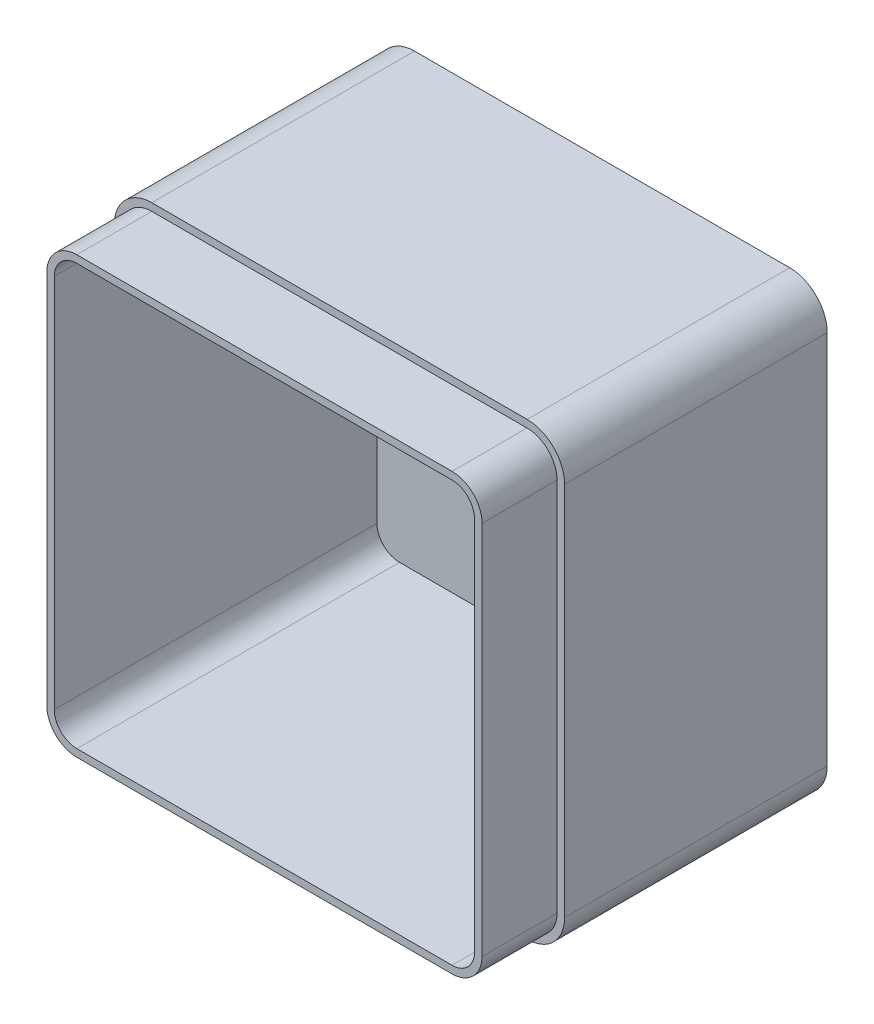
ISO-10303-21;
HEADER;
FILE_DESCRIPTION(('STEP AP214'),'2;1');
FILE_NAME('part.step','',(''),(''),'','','');
FILE_SCHEMA(('AUTOMOTIVE_DESIGN { 1 0 10303 214 1 1 1 1 }'));
ENDSEC;
DATA;
#1=APPLICATION_CONTEXT('core data for automotive mechanical design processes');
#2=APPLICATION_PROTOCOL_DEFINITION('international standard','automotive_design',2000,#1);
#3=PRODUCT_CONTEXT('',#1,'mechanical');
#4=PRODUCT('Part','Part','',(#3));
#5=PRODUCT_RELATED_PRODUCT_CATEGORY('part','',(#4));
#6=PRODUCT_DEFINITION_FORMATION('','',#4);
#7=PRODUCT_DEFINITION_CONTEXT('part definition',#1,'design');
#8=PRODUCT_DEFINITION('design','',#6,#7);
#9=PRODUCT_DEFINITION_SHAPE('','',#8);
#10=(LENGTH_UNIT() NAMED_UNIT(*) SI_UNIT(.MILLI.,.METRE.));
#11=(NAMED_UNIT(*) PLANE_ANGLE_UNIT() SI_UNIT($,.RADIAN.));
#12=(NAMED_UNIT(*) SI_UNIT($,.STERADIAN.) SOLID_ANGLE_UNIT());
#13=UNCERTAINTY_MEASURE_WITH_UNIT(LENGTH_MEASURE(1.E-05),#10,'distance_accuracy_value','');
#14=(GEOMETRIC_REPRESENTATION_CONTEXT(3) GLOBAL_UNCERTAINTY_ASSIGNED_CONTEXT((#13)) GLOBAL_UNIT_ASSIGNED_CONTEXT((#10,
#11,#12)) REPRESENTATION_CONTEXT('',''));
#15=CARTESIAN_POINT('',(0.,0.,0.));
#16=DIRECTION('',(0.,0.,1.));
#17=DIRECTION('',(1.,0.,0.));
#18=AXIS2_PLACEMENT_3D('',#15,#16,#17);
#19=CARTESIAN_POINT('',(0.,0.,90.));
#20=DIRECTION('',(0.,0.,-1.));
#21=DIRECTION('',(-1.,0.,0.));
#22=AXIS2_PLACEMENT_3D('',#19,#20,#21);
#23=PLANE('',#22);
#24=DIRECTION('',(0.,-1.,0.));
#25=VECTOR('',#24,1.);
#26=CARTESIAN_POINT('',(4.,0.,90.));
#27=LINE('',#26,#25);
#28=CARTESIAN_POINT('',(3.99999999999999,110.,90.));
#29=VERTEX_POINT('',#28);
#30=CARTESIAN_POINT('',(4.,10.,90.));
#31=VERTEX_POINT('',#30);
#32=EDGE_CURVE('E304',#29,#31,#27,.T.);
#33=ORIENTED_EDGE('',*,*,#32,.F.);
#34=CARTESIAN_POINT('',(9.99999999999999,110.,90.));
#35=DIRECTION('',(0.,0.,-1.));
#36=DIRECTION('',(-1.,0.,0.));
#37=AXIS2_PLACEMENT_3D('',#34,#35,#36);
#38=CIRCLE('',#37,6.);
#39=CARTESIAN_POINT('',(9.99999999999998,116.,90.));
#40=VERTEX_POINT('',#39);
#41=EDGE_CURVE('E337',#40,#29,#38,.F.);
#42=ORIENTED_EDGE('',*,*,#41,.F.);
#43=DIRECTION('',(-1.,0.,0.));
#44=VECTOR('',#43,1.);
#45=CARTESIAN_POINT('',(0.,116.,90.));
#46=LINE('',#45,#44);
#47=CARTESIAN_POINT('',(110.,116.,90.));
#48=VERTEX_POINT('',#47);
#49=EDGE_CURVE('E314',#48,#40,#46,.T.);
#50=ORIENTED_EDGE('',*,*,#49,.F.);
#51=CARTESIAN_POINT('',(110.,110.,90.));
#52=DIRECTION('',(0.,0.,-1.));
#53=DIRECTION('',(-1.,0.,0.));
#54=AXIS2_PLACEMENT_3D('',#51,#52,#53);
#55=CIRCLE('',#54,6.);
#56=CARTESIAN_POINT('',(116.,110.,90.));
#57=VERTEX_POINT('',#56);
#58=EDGE_CURVE('E288',#57,#48,#55,.F.);
#59=ORIENTED_EDGE('',*,*,#58,.F.);
#60=DIRECTION('',(0.,1.,0.));
#61=VECTOR('',#60,1.);
#62=CARTESIAN_POINT('',(116.,0.,90.));
#63=LINE('',#62,#61);
#64=CARTESIAN_POINT('',(116.,10.,90.));
#65=VERTEX_POINT('',#64);
#66=EDGE_CURVE('E335',#65,#57,#63,.T.);
#67=ORIENTED_EDGE('',*,*,#66,.F.);
#68=CARTESIAN_POINT('',(110.,10.,90.));
#69=DIRECTION('',(0.,0.,-1.));
#70=DIRECTION('',(-1.,0.,0.));
#71=AXIS2_PLACEMENT_3D('',#68,#69,#70);
#72=CIRCLE('',#71,6.);
#73=CARTESIAN_POINT('',(110.,4.,90.));
#74=VERTEX_POINT('',#73);
#75=EDGE_CURVE('E332',#74,#65,#72,.F.);
#76=ORIENTED_EDGE('',*,*,#75,.F.);
#77=DIRECTION('',(1.,0.,0.));
#78=VECTOR('',#77,1.);
#79=CARTESIAN_POINT('',(0.,4.,90.));
#80=LINE('',#79,#78);
#81=CARTESIAN_POINT('',(9.99999999999999,4.,90.));
#82=VERTEX_POINT('',#81);
#83=EDGE_CURVE('E330',#82,#74,#80,.T.);
#84=ORIENTED_EDGE('',*,*,#83,.F.);
#85=CARTESIAN_POINT('',(9.99999999999999,10.,90.));
#86=DIRECTION('',(0.,0.,-1.));
#87=DIRECTION('',(-1.,0.,0.));
#88=AXIS2_PLACEMENT_3D('',#85,#86,#87);
#89=CIRCLE('',#88,6.);
#90=EDGE_CURVE('E321',#31,#82,#89,.F.);
#91=ORIENTED_EDGE('',*,*,#90,.F.);
#92=EDGE_LOOP('',(#33,#42,#50,#59,#67,#76,#84,#91));
#93=FACE_BOUND('',#92,.T.);
#94=CARTESIAN_POINT('',(9.99999999999999,110.,90.));
#95=DIRECTION('',(0.,0.,1.));
#96=DIRECTION('',(1.,0.,0.));
#97=AXIS2_PLACEMENT_3D('',#94,#95,#96);
#98=CIRCLE('',#97,8.);
#99=CARTESIAN_POINT('',(9.99999999999998,118.,90.));
#100=VERTEX_POINT('',#99);
#101=CARTESIAN_POINT('',(1.99999999999999,110.,90.));
#102=VERTEX_POINT('',#101);
#103=EDGE_CURVE('E240',#100,#102,#98,.T.);
#104=ORIENTED_EDGE('',*,*,#103,.T.);
#105=DIRECTION('',(0.,-1.,0.));
#106=VECTOR('',#105,1.);
#107=CARTESIAN_POINT('',(1.99999999999999,110.,90.));
#108=LINE('',#107,#106);
#109=CARTESIAN_POINT('',(2.,9.99999999999999,90.));
#110=VERTEX_POINT('',#109);
#111=EDGE_CURVE('E200',#102,#110,#108,.T.);
#112=ORIENTED_EDGE('',*,*,#111,.T.);
#113=CARTESIAN_POINT('',(9.99999999999999,10.,90.));
#114=DIRECTION('',(0.,0.,1.));
#115=DIRECTION('',(1.,0.,0.));
#116=AXIS2_PLACEMENT_3D('',#113,#114,#115);
#117=CIRCLE('',#116,8.);
#118=CARTESIAN_POINT('',(9.99999999999999,2.,90.));
#119=VERTEX_POINT('',#118);
#120=EDGE_CURVE('E48',#110,#119,#117,.T.);
#121=ORIENTED_EDGE('',*,*,#120,.T.);
#122=DIRECTION('',(1.,0.,0.));
#123=VECTOR('',#122,1.);
#124=CARTESIAN_POINT('',(10.,2.,90.));
#125=LINE('',#124,#123);
#126=CARTESIAN_POINT('',(110.,2.,90.));
#127=VERTEX_POINT('',#126);
#128=EDGE_CURVE('E244',#119,#127,#125,.T.);
#129=ORIENTED_EDGE('',*,*,#128,.T.);
#130=CARTESIAN_POINT('',(110.,10.,90.));
#131=DIRECTION('',(0.,0.,1.));
#132=DIRECTION('',(1.,0.,0.));
#133=AXIS2_PLACEMENT_3D('',#130,#131,#132);
#134=CIRCLE('',#133,7.99999999999999);
#135=CARTESIAN_POINT('',(118.,10.,90.));
#136=VERTEX_POINT('',#135);
#137=EDGE_CURVE('E247',#127,#136,#134,.T.);
#138=ORIENTED_EDGE('',*,*,#137,.T.);
#139=DIRECTION('',(0.,1.,0.));
#140=VECTOR('',#139,1.);
#141=CARTESIAN_POINT('',(118.,10.,90.));
#142=LINE('',#141,#140);
#143=CARTESIAN_POINT('',(118.,110.,90.));
#144=VERTEX_POINT('',#143);
#145=EDGE_CURVE('E250',#136,#144,#142,.T.);
#146=ORIENTED_EDGE('',*,*,#145,.T.);
#147=CARTESIAN_POINT('',(110.,110.,90.));
#148=DIRECTION('',(0.,0.,1.));
#149=DIRECTION('',(1.,0.,0.));
#150=AXIS2_PLACEMENT_3D('',#147,#148,#149);
#151=CIRCLE('',#150,7.99999999999999);
#152=CARTESIAN_POINT('',(110.,118.,90.));
#153=VERTEX_POINT('',#152);
#154=EDGE_CURVE('E223',#144,#153,#151,.T.);
#155=ORIENTED_EDGE('',*,*,#154,.T.);
#156=DIRECTION('',(-1.,0.,0.));
#157=VECTOR('',#156,1.);
#158=CARTESIAN_POINT('',(110.,118.,90.));
#159=LINE('',#158,#157);
#160=EDGE_CURVE('E220',#153,#100,#159,.T.);
#161=ORIENTED_EDGE('',*,*,#160,.T.);
#162=EDGE_LOOP('',(#104,#112,#121,#129,#138,#146,#155,#161));
#163=FACE_BOUND('',#162,.T.);
#164=ADVANCED_FACE('F33',(#93,#163),#23,.F.);
#165=CARTESIAN_POINT('',(4.,0.,90.));
#166=DIRECTION('',(1.,0.,0.));
#167=DIRECTION('',(0.,1.,0.));
#168=AXIS2_PLACEMENT_3D('',#165,#166,#167);
#169=PLANE('',#168);
#170=DIRECTION('',(0.,-1.,0.));
#171=VECTOR('',#170,1.);
#172=CARTESIAN_POINT('',(4.,0.,4.));
#173=LINE('',#172,#171);
#174=CARTESIAN_POINT('',(3.99999999999999,110.,4.));
#175=VERTEX_POINT('',#174);
#176=CARTESIAN_POINT('',(4.,10.,4.));
#177=VERTEX_POINT('',#176);
#178=EDGE_CURVE('E282',#175,#177,#173,.T.);
#179=ORIENTED_EDGE('',*,*,#178,.F.);
#180=DIRECTION('',(0.,0.,1.));
#181=VECTOR('',#180,1.);
#182=CARTESIAN_POINT('',(3.99999999999999,110.,90.));
#183=LINE('',#182,#181);
#184=EDGE_CURVE('E289',#29,#175,#183,.F.);
#185=ORIENTED_EDGE('',*,*,#184,.F.);
#186=ORIENTED_EDGE('',*,*,#32,.T.);
#187=DIRECTION('',(0.,0.,1.));
#188=VECTOR('',#187,1.);
#189=CARTESIAN_POINT('',(4.,10.,90.));
#190=LINE('',#189,#188);
#191=EDGE_CURVE('E286',#177,#31,#190,.T.);
#192=ORIENTED_EDGE('',*,*,#191,.F.);
#193=EDGE_LOOP('',(#179,#185,#186,#192));
#194=FACE_BOUND('',#193,.T.);
#195=ADVANCED_FACE('F426',(#194),#169,.T.);
#196=CARTESIAN_POINT('',(0.,4.,90.));
#197=DIRECTION('',(0.,1.,0.));
#198=DIRECTION('',(0.,0.,1.));
#199=AXIS2_PLACEMENT_3D('',#196,#197,#198);
#200=PLANE('',#199);
#201=ORIENTED_EDGE('',*,*,#83,.T.);
#202=DIRECTION('',(0.,0.,1.));
#203=VECTOR('',#202,1.);
#204=CARTESIAN_POINT('',(110.,4.,90.));
#205=LINE('',#204,#203);
#206=CARTESIAN_POINT('',(110.,4.,4.));
#207=VERTEX_POINT('',#206);
#208=EDGE_CURVE('E312',#207,#74,#205,.T.);
#209=ORIENTED_EDGE('',*,*,#208,.F.);
#210=DIRECTION('',(1.,0.,0.));
#211=VECTOR('',#210,1.);
#212=CARTESIAN_POINT('',(0.,4.,4.));
#213=LINE('',#212,#211);
#214=CARTESIAN_POINT('',(9.99999999999999,4.,4.));
#215=VERTEX_POINT('',#214);
#216=EDGE_CURVE('E285',#215,#207,#213,.T.);
#217=ORIENTED_EDGE('',*,*,#216,.F.);
#218=DIRECTION('',(0.,0.,1.));
#219=VECTOR('',#218,1.);
#220=CARTESIAN_POINT('',(9.99999999999999,4.,90.));
#221=LINE('',#220,#219);
#222=EDGE_CURVE('E306',#82,#215,#221,.F.);
#223=ORIENTED_EDGE('',*,*,#222,.F.);
#224=EDGE_LOOP('',(#201,#209,#217,#223));
#225=FACE_BOUND('',#224,.T.);
#226=ADVANCED_FACE('F432',(#225),#200,.T.);
#227=CARTESIAN_POINT('',(116.,0.,90.));
#228=DIRECTION('',(-1.,0.,0.));
#229=DIRECTION('',(0.,-1.,0.));
#230=AXIS2_PLACEMENT_3D('',#227,#228,#229);
#231=PLANE('',#230);
#232=ORIENTED_EDGE('',*,*,#66,.T.);
#233=DIRECTION('',(0.,0.,1.));
#234=VECTOR('',#233,1.);
#235=CARTESIAN_POINT('',(116.,110.,90.));
#236=LINE('',#235,#234);
#237=CARTESIAN_POINT('',(116.,110.,4.));
#238=VERTEX_POINT('',#237);
#239=EDGE_CURVE('E319',#238,#57,#236,.T.);
#240=ORIENTED_EDGE('',*,*,#239,.F.);
#241=DIRECTION('',(0.,1.,0.));
#242=VECTOR('',#241,1.);
#243=CARTESIAN_POINT('',(116.,0.,4.));
#244=LINE('',#243,#242);
#245=CARTESIAN_POINT('',(116.,10.,4.));
#246=VERTEX_POINT('',#245);
#247=EDGE_CURVE('E295',#246,#238,#244,.T.);
#248=ORIENTED_EDGE('',*,*,#247,.F.);
#249=DIRECTION('',(0.,0.,1.));
#250=VECTOR('',#249,1.);
#251=CARTESIAN_POINT('',(116.,10.,90.));
#252=LINE('',#251,#250);
#253=EDGE_CURVE('E315',#65,#246,#252,.F.);
#254=ORIENTED_EDGE('',*,*,#253,.F.);
#255=EDGE_LOOP('',(#232,#240,#248,#254));
#256=FACE_BOUND('',#255,.T.);
#257=ADVANCED_FACE('F626',(#256),#231,.T.);
#258=CARTESIAN_POINT('',(0.,116.,90.));
#259=DIRECTION('',(0.,-1.,0.));
#260=DIRECTION('',(0.,0.,-1.));
#261=AXIS2_PLACEMENT_3D('',#258,#259,#260);
#262=PLANE('',#261);
#263=DIRECTION('',(-1.,0.,0.));
#264=VECTOR('',#263,1.);
#265=CARTESIAN_POINT('',(0.,116.,4.));
#266=LINE('',#265,#264);
#267=CARTESIAN_POINT('',(110.,116.,4.));
#268=VERTEX_POINT('',#267);
#269=CARTESIAN_POINT('',(9.99999999999998,116.,4.));
#270=VERTEX_POINT('',#269);
#271=EDGE_CURVE('E301',#268,#270,#266,.T.);
#272=ORIENTED_EDGE('',*,*,#271,.F.);
#273=DIRECTION('',(0.,0.,-1.));
#274=VECTOR('',#273,1.);
#275=CARTESIAN_POINT('',(110.,116.,90.));
#276=LINE('',#275,#274);
#277=EDGE_CURVE('E318',#48,#268,#276,.T.);
#278=ORIENTED_EDGE('',*,*,#277,.F.);
#279=ORIENTED_EDGE('',*,*,#49,.T.);
#280=DIRECTION('',(0.,0.,-1.));
#281=VECTOR('',#280,1.);
#282=CARTESIAN_POINT('',(9.99999999999998,116.,90.));
#283=LINE('',#282,#281);
#284=EDGE_CURVE('E324',#270,#40,#283,.F.);
#285=ORIENTED_EDGE('',*,*,#284,.F.);
#286=EDGE_LOOP('',(#272,#278,#279,#285));
#287=FACE_BOUND('',#286,.T.);
#288=ADVANCED_FACE('F616',(#287),#262,.T.);
#289=CARTESIAN_POINT('',(0.,0.,4.));
#290=DIRECTION('',(0.,0.,-1.));
#291=DIRECTION('',(-1.,0.,0.));
#292=AXIS2_PLACEMENT_3D('',#289,#290,#291);
#293=PLANE('',#292);
#294=ORIENTED_EDGE('',*,*,#216,.T.);
#295=CARTESIAN_POINT('',(110.,10.,4.));
#296=DIRECTION('',(0.,0.,-1.));
#297=DIRECTION('',(-1.,0.,0.));
#298=AXIS2_PLACEMENT_3D('',#295,#296,#297);
#299=CIRCLE('',#298,6.);
#300=EDGE_CURVE('E297',#246,#207,#299,.T.);
#301=ORIENTED_EDGE('',*,*,#300,.F.);
#302=ORIENTED_EDGE('',*,*,#247,.T.);
#303=CARTESIAN_POINT('',(110.,110.,4.));
#304=DIRECTION('',(0.,0.,-1.));
#305=DIRECTION('',(-1.,0.,0.));
#306=AXIS2_PLACEMENT_3D('',#303,#304,#305);
#307=CIRCLE('',#306,6.);
#308=EDGE_CURVE('E300',#268,#238,#307,.T.);
#309=ORIENTED_EDGE('',*,*,#308,.F.);
#310=ORIENTED_EDGE('',*,*,#271,.T.);
#311=CARTESIAN_POINT('',(9.99999999999999,110.,4.));
#312=DIRECTION('',(0.,0.,-1.));
#313=DIRECTION('',(-1.,0.,0.));
#314=AXIS2_PLACEMENT_3D('',#311,#312,#313);
#315=CIRCLE('',#314,6.);
#316=EDGE_CURVE('E298',#175,#270,#315,.T.);
#317=ORIENTED_EDGE('',*,*,#316,.F.);
#318=ORIENTED_EDGE('',*,*,#178,.T.);
#319=CARTESIAN_POINT('',(9.99999999999999,10.,4.));
#320=DIRECTION('',(0.,0.,-1.));
#321=DIRECTION('',(-1.,0.,0.));
#322=AXIS2_PLACEMENT_3D('',#319,#320,#321);
#323=CIRCLE('',#322,6.);
#324=EDGE_CURVE('E292',#215,#177,#323,.T.);
#325=ORIENTED_EDGE('',*,*,#324,.F.);
#326=EDGE_LOOP('',(#294,#301,#302,#309,#310,#317,#318,#325));
#327=FACE_BOUND('',#326,.T.);
#328=ADVANCED_FACE('F606',(#327),#293,.F.);
#329=CARTESIAN_POINT('',(9.99999999999999,10.,90.));
#330=DIRECTION('',(0.,0.,-1.));
#331=DIRECTION('',(-1.,0.,0.));
#332=AXIS2_PLACEMENT_3D('',#329,#330,#331);
#333=CYLINDRICAL_SURFACE('',#332,6.);
#334=ORIENTED_EDGE('',*,*,#90,.T.);
#335=ORIENTED_EDGE('',*,*,#222,.T.);
#336=ORIENTED_EDGE('',*,*,#324,.T.);
#337=ORIENTED_EDGE('',*,*,#191,.T.);
#338=EDGE_LOOP('',(#334,#335,#336,#337));
#339=FACE_BOUND('',#338,.T.);
#340=ADVANCED_FACE('F596',(#339),#333,.F.);
#341=CARTESIAN_POINT('',(110.,10.,90.));
#342=DIRECTION('',(0.,0.,-1.));
#343=DIRECTION('',(-1.,0.,0.));
#344=AXIS2_PLACEMENT_3D('',#341,#342,#343);
#345=CYLINDRICAL_SURFACE('',#344,6.);
#346=ORIENTED_EDGE('',*,*,#75,.T.);
#347=ORIENTED_EDGE('',*,*,#253,.T.);
#348=ORIENTED_EDGE('',*,*,#300,.T.);
#349=ORIENTED_EDGE('',*,*,#208,.T.);
#350=EDGE_LOOP('',(#346,#347,#348,#349));
#351=FACE_BOUND('',#350,.T.);
#352=ADVANCED_FACE('F587',(#351),#345,.F.);
#353=CARTESIAN_POINT('',(9.99999999999999,110.,90.));
#354=DIRECTION('',(0.,0.,-1.));
#355=DIRECTION('',(-1.,0.,0.));
#356=AXIS2_PLACEMENT_3D('',#353,#354,#355);
#357=CYLINDRICAL_SURFACE('',#356,6.);
#358=ORIENTED_EDGE('',*,*,#41,.T.);
#359=ORIENTED_EDGE('',*,*,#184,.T.);
#360=ORIENTED_EDGE('',*,*,#316,.T.);
#361=ORIENTED_EDGE('',*,*,#284,.T.);
#362=EDGE_LOOP('',(#358,#359,#360,#361));
#363=FACE_BOUND('',#362,.T.);
#364=ADVANCED_FACE('F578',(#363),#357,.F.);
#365=CARTESIAN_POINT('',(110.,110.,90.));
#366=DIRECTION('',(0.,0.,-1.));
#367=DIRECTION('',(-1.,0.,0.));
#368=AXIS2_PLACEMENT_3D('',#365,#366,#367);
#369=CYLINDRICAL_SURFACE('',#368,6.);
#370=ORIENTED_EDGE('',*,*,#58,.T.);
#371=ORIENTED_EDGE('',*,*,#277,.T.);
#372=ORIENTED_EDGE('',*,*,#308,.T.);
#373=ORIENTED_EDGE('',*,*,#239,.T.);
#374=EDGE_LOOP('',(#370,#371,#372,#373));
#375=FACE_BOUND('',#374,.T.);
#376=ADVANCED_FACE('F439',(#375),#369,.F.);
#377=CARTESIAN_POINT('',(9.99999999999999,110.,70.));
#378=DIRECTION('',(0.,0.,1.));
#379=DIRECTION('',(1.,0.,0.));
#380=AXIS2_PLACEMENT_3D('',#377,#378,#379);
#381=PLANE('',#380);
#382=DIRECTION('',(-1.,0.,0.));
#383=VECTOR('',#382,1.);
#384=CARTESIAN_POINT('',(110.,118.,70.));
#385=LINE('',#384,#383);
#386=CARTESIAN_POINT('',(110.,118.,70.));
#387=VERTEX_POINT('',#386);
#388=CARTESIAN_POINT('',(9.99999999999998,118.,70.));
#389=VERTEX_POINT('',#388);
#390=EDGE_CURVE('E206',#387,#389,#385,.T.);
#391=ORIENTED_EDGE('',*,*,#390,.F.);
#392=CARTESIAN_POINT('',(110.,110.,70.));
#393=DIRECTION('',(0.,0.,1.));
#394=DIRECTION('',(1.,0.,0.));
#395=AXIS2_PLACEMENT_3D('',#392,#393,#394);
#396=CIRCLE('',#395,7.99999999999999);
#397=CARTESIAN_POINT('',(118.,110.,70.));
#398=VERTEX_POINT('',#397);
#399=EDGE_CURVE('E236',#398,#387,#396,.T.);
#400=ORIENTED_EDGE('',*,*,#399,.F.);
#401=DIRECTION('',(0.,1.,0.));
#402=VECTOR('',#401,1.);
#403=CARTESIAN_POINT('',(118.,10.,70.));
#404=LINE('',#403,#402);
#405=CARTESIAN_POINT('',(118.,10.,70.));
#406=VERTEX_POINT('',#405);
#407=EDGE_CURVE('E233',#406,#398,#404,.T.);
#408=ORIENTED_EDGE('',*,*,#407,.F.);
#409=CARTESIAN_POINT('',(110.,10.,70.));
#410=DIRECTION('',(0.,0.,1.));
#411=DIRECTION('',(1.,0.,0.));
#412=AXIS2_PLACEMENT_3D('',#409,#410,#411);
#413=CIRCLE('',#412,7.99999999999999);
#414=CARTESIAN_POINT('',(110.,2.,70.));
#415=VERTEX_POINT('',#414);
#416=EDGE_CURVE('E230',#415,#406,#413,.T.);
#417=ORIENTED_EDGE('',*,*,#416,.F.);
#418=DIRECTION('',(1.,0.,0.));
#419=VECTOR('',#418,1.);
#420=CARTESIAN_POINT('',(10.,2.,70.));
#421=LINE('',#420,#419);
#422=CARTESIAN_POINT('',(9.99999999999999,2.,70.));
#423=VERTEX_POINT('',#422);
#424=EDGE_CURVE('E227',#423,#415,#421,.T.);
#425=ORIENTED_EDGE('',*,*,#424,.F.);
#426=CARTESIAN_POINT('',(9.99999999999999,10.,70.));
#427=DIRECTION('',(0.,0.,1.));
#428=DIRECTION('',(1.,0.,0.));
#429=AXIS2_PLACEMENT_3D('',#426,#427,#428);
#430=CIRCLE('',#429,8.);
#431=CARTESIAN_POINT('',(2.,9.99999999999999,70.));
#432=VERTEX_POINT('',#431);
#433=EDGE_CURVE('E216',#432,#423,#430,.T.);
#434=ORIENTED_EDGE('',*,*,#433,.F.);
#435=DIRECTION('',(0.,-1.,0.));
#436=VECTOR('',#435,1.);
#437=CARTESIAN_POINT('',(1.99999999999999,110.,70.));
#438=LINE('',#437,#436);
#439=CARTESIAN_POINT('',(1.99999999999999,110.,70.));
#440=VERTEX_POINT('',#439);
#441=EDGE_CURVE('E198',#440,#432,#438,.T.);
#442=ORIENTED_EDGE('',*,*,#441,.F.);
#443=CARTESIAN_POINT('',(9.99999999999999,110.,70.));
#444=DIRECTION('',(0.,0.,1.));
#445=DIRECTION('',(1.,0.,0.));
#446=AXIS2_PLACEMENT_3D('',#443,#444,#445);
#447=CIRCLE('',#446,8.);
#448=EDGE_CURVE('E212',#389,#440,#447,.T.);
#449=ORIENTED_EDGE('',*,*,#448,.F.);
#450=EDGE_LOOP('',(#391,#400,#408,#417,#425,#434,#442,#449));
#451=FACE_BOUND('',#450,.T.);
#452=CARTESIAN_POINT('',(9.99999999999999,110.,70.));
#453=DIRECTION('',(0.,0.,1.));
#454=DIRECTION('',(1.,0.,0.));
#455=AXIS2_PLACEMENT_3D('',#452,#453,#454);
#456=CIRCLE('',#455,10.);
#457=CARTESIAN_POINT('',(9.99999999999998,120.,70.));
#458=VERTEX_POINT('',#457);
#459=CARTESIAN_POINT('',(0.,110.,70.));
#460=VERTEX_POINT('',#459);
#461=EDGE_CURVE('E256',#458,#460,#456,.T.);
#462=ORIENTED_EDGE('',*,*,#461,.T.);
#463=DIRECTION('',(0.,-1.,0.));
#464=VECTOR('',#463,1.);
#465=CARTESIAN_POINT('',(0.,110.,70.));
#466=LINE('',#465,#464);
#467=CARTESIAN_POINT('',(0.,10.,70.));
#468=VERTEX_POINT('',#467);
#469=EDGE_CURVE('E269',#460,#468,#466,.T.);
#470=ORIENTED_EDGE('',*,*,#469,.T.);
#471=CARTESIAN_POINT('',(9.99999999999999,10.,70.));
#472=DIRECTION('',(0.,0.,1.));
#473=DIRECTION('',(1.,0.,0.));
#474=AXIS2_PLACEMENT_3D('',#471,#472,#473);
#475=CIRCLE('',#474,10.);
#476=CARTESIAN_POINT('',(9.99999999999999,0.,70.));
#477=VERTEX_POINT('',#476);
#478=EDGE_CURVE('E271',#468,#477,#475,.T.);
#479=ORIENTED_EDGE('',*,*,#478,.T.);
#480=DIRECTION('',(1.,0.,0.));
#481=VECTOR('',#480,1.);
#482=CARTESIAN_POINT('',(9.99999999999999,0.,70.));
#483=LINE('',#482,#481);
#484=CARTESIAN_POINT('',(110.,0.,70.));
#485=VERTEX_POINT('',#484);
#486=EDGE_CURVE('E273',#477,#485,#483,.T.);
#487=ORIENTED_EDGE('',*,*,#486,.T.);
#488=CARTESIAN_POINT('',(110.,10.,70.));
#489=DIRECTION('',(0.,0.,1.));
#490=DIRECTION('',(1.,0.,0.));
#491=AXIS2_PLACEMENT_3D('',#488,#489,#490);
#492=CIRCLE('',#491,9.99999999999999);
#493=CARTESIAN_POINT('',(120.,10.,70.));
#494=VERTEX_POINT('',#493);
#495=EDGE_CURVE('E275',#485,#494,#492,.T.);
#496=ORIENTED_EDGE('',*,*,#495,.T.);
#497=DIRECTION('',(0.,1.,0.));
#498=VECTOR('',#497,1.);
#499=CARTESIAN_POINT('',(120.,10.,70.));
#500=LINE('',#499,#498);
#501=CARTESIAN_POINT('',(120.,110.,70.));
#502=VERTEX_POINT('',#501);
#503=EDGE_CURVE('E56',#494,#502,#500,.T.);
#504=ORIENTED_EDGE('',*,*,#503,.T.);
#505=CARTESIAN_POINT('',(110.,110.,70.));
#506=DIRECTION('',(0.,0.,1.));
#507=DIRECTION('',(1.,0.,0.));
#508=AXIS2_PLACEMENT_3D('',#505,#506,#507);
#509=CIRCLE('',#508,9.99999999999999);
#510=CARTESIAN_POINT('',(110.,120.,70.));
#511=VERTEX_POINT('',#510);
#512=EDGE_CURVE('E278',#502,#511,#509,.T.);
#513=ORIENTED_EDGE('',*,*,#512,.T.);
#514=DIRECTION('',(-1.,0.,0.));
#515=VECTOR('',#514,1.);
#516=CARTESIAN_POINT('',(110.,120.,70.));
#517=LINE('',#516,#515);
#518=EDGE_CURVE('E280',#511,#458,#517,.T.);
#519=ORIENTED_EDGE('',*,*,#518,.T.);
#520=EDGE_LOOP('',(#462,#470,#479,#487,#496,#504,#513,#519));
#521=FACE_BOUND('',#520,.T.);
#522=ADVANCED_FACE('F211',(#451,#521),#381,.T.);
#523=CARTESIAN_POINT('',(9.99999999999999,110.,70.));
#524=DIRECTION('',(0.,0.,1.));
#525=DIRECTION('',(1.,0.,0.));
#526=AXIS2_PLACEMENT_3D('',#523,#524,#525);
#527=CYLINDRICAL_SURFACE('',#526,8.);
#528=ORIENTED_EDGE('',*,*,#103,.F.);
#529=DIRECTION('',(0.,0.,1.));
#530=VECTOR('',#529,1.);
#531=CARTESIAN_POINT('',(9.99999999999998,118.,70.));
#532=LINE('',#531,#530);
#533=EDGE_CURVE('E219',#389,#100,#532,.T.);
#534=ORIENTED_EDGE('',*,*,#533,.F.);
#535=ORIENTED_EDGE('',*,*,#448,.T.);
#536=DIRECTION('',(0.,0.,1.));
#537=VECTOR('',#536,1.);
#538=CARTESIAN_POINT('',(1.99999999999999,110.,70.));
#539=LINE('',#538,#537);
#540=EDGE_CURVE('E195',#440,#102,#539,.T.);
#541=ORIENTED_EDGE('',*,*,#540,.T.);
#542=EDGE_LOOP('',(#528,#534,#535,#541));
#543=FACE_BOUND('',#542,.T.);
#544=ADVANCED_FACE('F218',(#543),#527,.T.);
#545=CARTESIAN_POINT('',(110.,118.,70.));
#546=DIRECTION('',(0.,1.,0.));
#547=DIRECTION('',(0.,0.,1.));
#548=AXIS2_PLACEMENT_3D('',#545,#546,#547);
#549=PLANE('',#548);
#550=ORIENTED_EDGE('',*,*,#160,.F.);
#551=DIRECTION('',(0.,0.,1.));
#552=VECTOR('',#551,1.);
#553=CARTESIAN_POINT('',(110.,118.,70.));
#554=LINE('',#553,#552);
#555=EDGE_CURVE('E257',#387,#153,#554,.T.);
#556=ORIENTED_EDGE('',*,*,#555,.F.);
#557=ORIENTED_EDGE('',*,*,#390,.T.);
#558=ORIENTED_EDGE('',*,*,#533,.T.);
#559=EDGE_LOOP('',(#550,#556,#557,#558));
#560=FACE_BOUND('',#559,.T.);
#561=ADVANCED_FACE('F482',(#560),#549,.T.);
#562=CARTESIAN_POINT('',(110.,110.,70.));
#563=DIRECTION('',(0.,0.,1.));
#564=DIRECTION('',(1.,0.,0.));
#565=AXIS2_PLACEMENT_3D('',#562,#563,#564);
#566=CYLINDRICAL_SURFACE('',#565,7.99999999999999);
#567=ORIENTED_EDGE('',*,*,#154,.F.);
#568=DIRECTION('',(0.,0.,1.));
#569=VECTOR('',#568,1.);
#570=CARTESIAN_POINT('',(118.,110.,70.));
#571=LINE('',#570,#569);
#572=EDGE_CURVE('E259',#398,#144,#571,.T.);
#573=ORIENTED_EDGE('',*,*,#572,.F.);
#574=ORIENTED_EDGE('',*,*,#399,.T.);
#575=ORIENTED_EDGE('',*,*,#555,.T.);
#576=EDGE_LOOP('',(#567,#573,#574,#575));
#577=FACE_BOUND('',#576,.T.);
#578=ADVANCED_FACE('F490',(#577),#566,.T.);
#579=CARTESIAN_POINT('',(118.,10.,70.));
#580=DIRECTION('',(1.,0.,0.));
#581=DIRECTION('',(0.,1.,0.));
#582=AXIS2_PLACEMENT_3D('',#579,#580,#581);
#583=PLANE('',#582);
#584=ORIENTED_EDGE('',*,*,#145,.F.);
#585=DIRECTION('',(0.,0.,1.));
#586=VECTOR('',#585,1.);
#587=CARTESIAN_POINT('',(118.,10.,70.));
#588=LINE('',#587,#586);
#589=EDGE_CURVE('E261',#406,#136,#588,.T.);
#590=ORIENTED_EDGE('',*,*,#589,.F.);
#591=ORIENTED_EDGE('',*,*,#407,.T.);
#592=ORIENTED_EDGE('',*,*,#572,.T.);
#593=EDGE_LOOP('',(#584,#590,#591,#592));
#594=FACE_BOUND('',#593,.T.);
#595=ADVANCED_FACE('F499',(#594),#583,.T.);
#596=CARTESIAN_POINT('',(110.,10.,70.));
#597=DIRECTION('',(0.,0.,1.));
#598=DIRECTION('',(1.,0.,0.));
#599=AXIS2_PLACEMENT_3D('',#596,#597,#598);
#600=CYLINDRICAL_SURFACE('',#599,7.99999999999999);
#601=ORIENTED_EDGE('',*,*,#137,.F.);
#602=DIRECTION('',(0.,0.,1.));
#603=VECTOR('',#602,1.);
#604=CARTESIAN_POINT('',(110.,2.,70.));
#605=LINE('',#604,#603);
#606=EDGE_CURVE('E263',#415,#127,#605,.T.);
#607=ORIENTED_EDGE('',*,*,#606,.F.);
#608=ORIENTED_EDGE('',*,*,#416,.T.);
#609=ORIENTED_EDGE('',*,*,#589,.T.);
#610=EDGE_LOOP('',(#601,#607,#608,#609));
#611=FACE_BOUND('',#610,.T.);
#612=ADVANCED_FACE('F508',(#611),#600,.T.);
#613=CARTESIAN_POINT('',(10.,2.,70.));
#614=DIRECTION('',(0.,-1.,0.));
#615=DIRECTION('',(0.,0.,-1.));
#616=AXIS2_PLACEMENT_3D('',#613,#614,#615);
#617=PLANE('',#616);
#618=ORIENTED_EDGE('',*,*,#128,.F.);
#619=DIRECTION('',(0.,0.,1.));
#620=VECTOR('',#619,1.);
#621=CARTESIAN_POINT('',(9.99999999999999,2.,70.));
#622=LINE('',#621,#620);
#623=EDGE_CURVE('E265',#423,#119,#622,.T.);
#624=ORIENTED_EDGE('',*,*,#623,.F.);
#625=ORIENTED_EDGE('',*,*,#424,.T.);
#626=ORIENTED_EDGE('',*,*,#606,.T.);
#627=EDGE_LOOP('',(#618,#624,#625,#626));
#628=FACE_BOUND('',#627,.T.);
#629=ADVANCED_FACE('F517',(#628),#617,.T.);
#630=CARTESIAN_POINT('',(9.99999999999999,10.,70.));
#631=DIRECTION('',(0.,0.,1.));
#632=DIRECTION('',(1.,0.,0.));
#633=AXIS2_PLACEMENT_3D('',#630,#631,#632);
#634=CYLINDRICAL_SURFACE('',#633,8.);
#635=ORIENTED_EDGE('',*,*,#120,.F.);
#636=DIRECTION('',(0.,0.,1.));
#637=VECTOR('',#636,1.);
#638=CARTESIAN_POINT('',(2.,9.99999999999999,70.));
#639=LINE('',#638,#637);
#640=EDGE_CURVE('E205',#432,#110,#639,.T.);
#641=ORIENTED_EDGE('',*,*,#640,.F.);
#642=ORIENTED_EDGE('',*,*,#433,.T.);
#643=ORIENTED_EDGE('',*,*,#623,.T.);
#644=EDGE_LOOP('',(#635,#641,#642,#643));
#645=FACE_BOUND('',#644,.T.);
#646=ADVANCED_FACE('F526',(#645),#634,.T.);
#647=CARTESIAN_POINT('',(1.99999999999999,110.,70.));
#648=DIRECTION('',(-1.,0.,0.));
#649=DIRECTION('',(0.,-1.,0.));
#650=AXIS2_PLACEMENT_3D('',#647,#648,#649);
#651=PLANE('',#650);
#652=ORIENTED_EDGE('',*,*,#111,.F.);
#653=ORIENTED_EDGE('',*,*,#540,.F.);
#654=ORIENTED_EDGE('',*,*,#441,.T.);
#655=ORIENTED_EDGE('',*,*,#640,.T.);
#656=EDGE_LOOP('',(#652,#653,#654,#655));
#657=FACE_BOUND('',#656,.T.);
#658=ADVANCED_FACE('F197',(#657),#651,.T.);
#659=CARTESIAN_POINT('',(0.,0.,0.));
#660=DIRECTION('',(0.,0.,-1.));
#661=DIRECTION('',(-1.,0.,0.));
#662=AXIS2_PLACEMENT_3D('',#659,#660,#661);
#663=PLANE('',#662);
#664=DIRECTION('',(1.,0.,0.));
#665=VECTOR('',#664,1.);
#666=CARTESIAN_POINT('',(0.,0.,0.));
#667=LINE('',#666,#665);
#668=CARTESIAN_POINT('',(9.99999999999999,0.,0.));
#669=VERTEX_POINT('',#668);
#670=CARTESIAN_POINT('',(110.,0.,0.));
#671=VERTEX_POINT('',#670);
#672=EDGE_CURVE('E345',#669,#671,#667,.T.);
#673=ORIENTED_EDGE('',*,*,#672,.F.);
#674=CARTESIAN_POINT('',(9.99999999999999,10.,0.));
#675=DIRECTION('',(0.,0.,-1.));
#676=DIRECTION('',(-1.,0.,0.));
#677=AXIS2_PLACEMENT_3D('',#674,#675,#676);
#678=CIRCLE('',#677,10.);
#679=CARTESIAN_POINT('',(0.,10.,0.));
#680=VERTEX_POINT('',#679);
#681=EDGE_CURVE('E365',#669,#680,#678,.T.);
#682=ORIENTED_EDGE('',*,*,#681,.T.);
#683=DIRECTION('',(0.,-1.,0.));
#684=VECTOR('',#683,1.);
#685=CARTESIAN_POINT('',(0.,0.,0.));
#686=LINE('',#685,#684);
#687=CARTESIAN_POINT('',(0.,110.,0.));
#688=VERTEX_POINT('',#687);
#689=EDGE_CURVE('E327',#688,#680,#686,.T.);
#690=ORIENTED_EDGE('',*,*,#689,.F.);
#691=CARTESIAN_POINT('',(9.99999999999999,110.,0.));
#692=DIRECTION('',(0.,0.,-1.));
#693=DIRECTION('',(-1.,0.,0.));
#694=AXIS2_PLACEMENT_3D('',#691,#692,#693);
#695=CIRCLE('',#694,10.);
#696=CARTESIAN_POINT('',(9.99999999999998,120.,0.));
#697=VERTEX_POINT('',#696);
#698=EDGE_CURVE('E361',#688,#697,#695,.T.);
#699=ORIENTED_EDGE('',*,*,#698,.T.);
#700=DIRECTION('',(-1.,0.,0.));
#701=VECTOR('',#700,1.);
#702=CARTESIAN_POINT('',(0.,120.,0.));
#703=LINE('',#702,#701);
#704=CARTESIAN_POINT('',(110.,120.,0.));
#705=VERTEX_POINT('',#704);
#706=EDGE_CURVE('E351',#705,#697,#703,.T.);
#707=ORIENTED_EDGE('',*,*,#706,.F.);
#708=CARTESIAN_POINT('',(110.,110.,0.));
#709=DIRECTION('',(0.,0.,-1.));
#710=DIRECTION('',(-1.,0.,0.));
#711=AXIS2_PLACEMENT_3D('',#708,#709,#710);
#712=CIRCLE('',#711,10.);
#713=CARTESIAN_POINT('',(120.,110.,0.));
#714=VERTEX_POINT('',#713);
#715=EDGE_CURVE('E359',#705,#714,#712,.T.);
#716=ORIENTED_EDGE('',*,*,#715,.T.);
#717=DIRECTION('',(0.,1.,0.));
#718=VECTOR('',#717,1.);
#719=CARTESIAN_POINT('',(120.,0.,0.));
#720=LINE('',#719,#718);
#721=CARTESIAN_POINT('',(120.,10.,0.));
#722=VERTEX_POINT('',#721);
#723=EDGE_CURVE('E348',#722,#714,#720,.T.);
#724=ORIENTED_EDGE('',*,*,#723,.F.);
#725=CARTESIAN_POINT('',(110.,10.,0.));
#726=DIRECTION('',(0.,0.,-1.));
#727=DIRECTION('',(-1.,0.,0.));
#728=AXIS2_PLACEMENT_3D('',#725,#726,#727);
#729=CIRCLE('',#728,10.);
#730=EDGE_CURVE('E363',#722,#671,#729,.T.);
#731=ORIENTED_EDGE('',*,*,#730,.T.);
#732=EDGE_LOOP('',(#673,#682,#690,#699,#707,#716,#724,#731));
#733=FACE_BOUND('',#732,.T.);
#734=ADVANCED_FACE('F388',(#733),#663,.T.);
#735=CARTESIAN_POINT('',(9.99999999999999,110.,90.));
#736=DIRECTION('',(0.,0.,-1.));
#737=DIRECTION('',(-1.,0.,0.));
#738=AXIS2_PLACEMENT_3D('',#735,#736,#737);
#739=CYLINDRICAL_SURFACE('',#738,10.);
#740=DIRECTION('',(0.,0.,-1.));
#741=VECTOR('',#740,1.);
#742=CARTESIAN_POINT('',(0.,110.,90.));
#743=LINE('',#742,#741);
#744=EDGE_CURVE('E367',#460,#688,#743,.T.);
#745=ORIENTED_EDGE('',*,*,#744,.F.);
#746=ORIENTED_EDGE('',*,*,#461,.F.);
#747=DIRECTION('',(0.,0.,-1.));
#748=VECTOR('',#747,1.);
#749=CARTESIAN_POINT('',(9.99999999999999,120.,90.));
#750=LINE('',#749,#748);
#751=EDGE_CURVE('E11',#697,#458,#750,.F.);
#752=ORIENTED_EDGE('',*,*,#751,.F.);
#753=ORIENTED_EDGE('',*,*,#698,.F.);
#754=EDGE_LOOP('',(#745,#746,#752,#753));
#755=FACE_BOUND('',#754,.T.);
#756=ADVANCED_FACE('F393',(#755),#739,.T.);
#757=CARTESIAN_POINT('',(110.,110.,90.));
#758=DIRECTION('',(0.,0.,-1.));
#759=DIRECTION('',(-1.,0.,0.));
#760=AXIS2_PLACEMENT_3D('',#757,#758,#759);
#761=CYLINDRICAL_SURFACE('',#760,10.);
#762=DIRECTION('',(0.,0.,-1.));
#763=VECTOR('',#762,1.);
#764=CARTESIAN_POINT('',(110.,120.,90.));
#765=LINE('',#764,#763);
#766=EDGE_CURVE('E41',#511,#705,#765,.T.);
#767=ORIENTED_EDGE('',*,*,#766,.F.);
#768=ORIENTED_EDGE('',*,*,#512,.F.);
#769=DIRECTION('',(0.,0.,-1.));
#770=VECTOR('',#769,1.);
#771=CARTESIAN_POINT('',(120.,110.,90.));
#772=LINE('',#771,#770);
#773=EDGE_CURVE('E372',#714,#502,#772,.F.);
#774=ORIENTED_EDGE('',*,*,#773,.F.);
#775=ORIENTED_EDGE('',*,*,#715,.F.);
#776=EDGE_LOOP('',(#767,#768,#774,#775));
#777=FACE_BOUND('',#776,.T.);
#778=ADVANCED_FACE('F35',(#777),#761,.T.);
#779=CARTESIAN_POINT('',(0.,120.,90.));
#780=DIRECTION('',(0.,-1.,0.));
#781=DIRECTION('',(0.,0.,-1.));
#782=AXIS2_PLACEMENT_3D('',#779,#780,#781);
#783=PLANE('',#782);
#784=ORIENTED_EDGE('',*,*,#518,.F.);
#785=ORIENTED_EDGE('',*,*,#766,.T.);
#786=ORIENTED_EDGE('',*,*,#706,.T.);
#787=ORIENTED_EDGE('',*,*,#751,.T.);
#788=EDGE_LOOP('',(#784,#785,#786,#787));
#789=FACE_BOUND('',#788,.T.);
#790=ADVANCED_FACE('F380',(#789),#783,.F.);
#791=CARTESIAN_POINT('',(110.,10.,90.));
#792=DIRECTION('',(0.,0.,-1.));
#793=DIRECTION('',(-1.,0.,0.));
#794=AXIS2_PLACEMENT_3D('',#791,#792,#793);
#795=CYLINDRICAL_SURFACE('',#794,10.);
#796=DIRECTION('',(0.,0.,-1.));
#797=VECTOR('',#796,1.);
#798=CARTESIAN_POINT('',(120.,10.,90.));
#799=LINE('',#798,#797);
#800=EDGE_CURVE('E375',#494,#722,#799,.T.);
#801=ORIENTED_EDGE('',*,*,#800,.F.);
#802=ORIENTED_EDGE('',*,*,#495,.F.);
#803=DIRECTION('',(0.,0.,-1.));
#804=VECTOR('',#803,1.);
#805=CARTESIAN_POINT('',(110.,0.,90.));
#806=LINE('',#805,#804);
#807=EDGE_CURVE('E354',#671,#485,#806,.F.);
#808=ORIENTED_EDGE('',*,*,#807,.F.);
#809=ORIENTED_EDGE('',*,*,#730,.F.);
#810=EDGE_LOOP('',(#801,#802,#808,#809));
#811=FACE_BOUND('',#810,.T.);
#812=ADVANCED_FACE('F412',(#811),#795,.T.);
#813=CARTESIAN_POINT('',(120.,0.,90.));
#814=DIRECTION('',(-1.,0.,0.));
#815=DIRECTION('',(0.,-1.,0.));
#816=AXIS2_PLACEMENT_3D('',#813,#814,#815);
#817=PLANE('',#816);
#818=ORIENTED_EDGE('',*,*,#503,.F.);
#819=ORIENTED_EDGE('',*,*,#800,.T.);
#820=ORIENTED_EDGE('',*,*,#723,.T.);
#821=ORIENTED_EDGE('',*,*,#773,.T.);
#822=EDGE_LOOP('',(#818,#819,#820,#821));
#823=FACE_BOUND('',#822,.T.);
#824=ADVANCED_FACE('F414',(#823),#817,.F.);
#825=CARTESIAN_POINT('',(9.99999999999999,10.,90.));
#826=DIRECTION('',(0.,0.,-1.));
#827=DIRECTION('',(-1.,0.,0.));
#828=AXIS2_PLACEMENT_3D('',#825,#826,#827);
#829=CYLINDRICAL_SURFACE('',#828,10.);
#830=DIRECTION('',(0.,0.,-1.));
#831=VECTOR('',#830,1.);
#832=CARTESIAN_POINT('',(9.99999999999999,0.,90.));
#833=LINE('',#832,#831);
#834=EDGE_CURVE('E357',#477,#669,#833,.T.);
#835=ORIENTED_EDGE('',*,*,#834,.F.);
#836=ORIENTED_EDGE('',*,*,#478,.F.);
#837=DIRECTION('',(0.,0.,-1.));
#838=VECTOR('',#837,1.);
#839=CARTESIAN_POINT('',(0.,10.,90.));
#840=LINE('',#839,#838);
#841=EDGE_CURVE('E369',#680,#468,#840,.F.);
#842=ORIENTED_EDGE('',*,*,#841,.F.);
#843=ORIENTED_EDGE('',*,*,#681,.F.);
#844=EDGE_LOOP('',(#835,#836,#842,#843));
#845=FACE_BOUND('',#844,.T.);
#846=ADVANCED_FACE('F403',(#845),#829,.T.);
#847=CARTESIAN_POINT('',(0.,0.,90.));
#848=DIRECTION('',(0.,1.,0.));
#849=DIRECTION('',(0.,0.,1.));
#850=AXIS2_PLACEMENT_3D('',#847,#848,#849);
#851=PLANE('',#850);
#852=ORIENTED_EDGE('',*,*,#486,.F.);
#853=ORIENTED_EDGE('',*,*,#834,.T.);
#854=ORIENTED_EDGE('',*,*,#672,.T.);
#855=ORIENTED_EDGE('',*,*,#807,.T.);
#856=EDGE_LOOP('',(#852,#853,#854,#855));
#857=FACE_BOUND('',#856,.T.);
#858=ADVANCED_FACE('F407',(#857),#851,.F.);
#859=CARTESIAN_POINT('',(0.,0.,90.));
#860=DIRECTION('',(1.,0.,0.));
#861=DIRECTION('',(0.,1.,0.));
#862=AXIS2_PLACEMENT_3D('',#859,#860,#861);
#863=PLANE('',#862);
#864=ORIENTED_EDGE('',*,*,#469,.F.);
#865=ORIENTED_EDGE('',*,*,#744,.T.);
#866=ORIENTED_EDGE('',*,*,#689,.T.);
#867=ORIENTED_EDGE('',*,*,#841,.T.);
#868=EDGE_LOOP('',(#864,#865,#866,#867));
#869=FACE_BOUND('',#868,.T.);
#870=ADVANCED_FACE('F398',(#869),#863,.F.);
#871=CLOSED_SHELL('',(#164,#195,#226,#257,#288,#328,#340,#352,#364,#376,#522,#544,#561,#578,
#595,#612,#629,#646,#658,#734,#756,#778,#790,#812,#824,#846,#858,#870));
#872=MANIFOLD_SOLID_BREP('B2',#871);
#873=ADVANCED_BREP_SHAPE_REPRESENTATION('',(#18,#872),#14);
#874=SHAPE_DEFINITION_REPRESENTATION(#9,#873);
ENDSEC;
END-ISO-10303-21;
